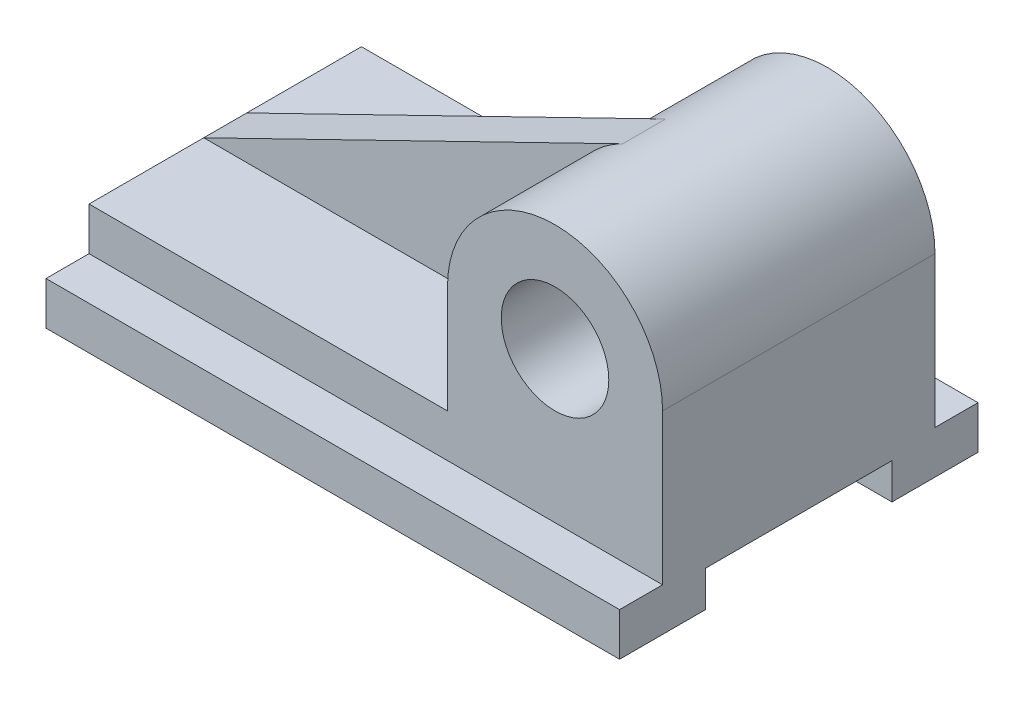
ISO-10303-21;
HEADER;
FILE_DESCRIPTION(('STEP AP214'),'2;1');
FILE_NAME('part.step','',(''),(''),'','','');
FILE_SCHEMA(('AUTOMOTIVE_DESIGN { 1 0 10303 214 1 1 1 1 }'));
ENDSEC;
DATA;
#1=APPLICATION_CONTEXT('core data for automotive mechanical design processes');
#2=APPLICATION_PROTOCOL_DEFINITION('international standard','automotive_design',2000,#1);
#3=PRODUCT_CONTEXT('',#1,'mechanical');
#4=PRODUCT('Part','Part','',(#3));
#5=PRODUCT_RELATED_PRODUCT_CATEGORY('part','',(#4));
#6=PRODUCT_DEFINITION_FORMATION('','',#4);
#7=PRODUCT_DEFINITION_CONTEXT('part definition',#1,'design');
#8=PRODUCT_DEFINITION('design','',#6,#7);
#9=PRODUCT_DEFINITION_SHAPE('','',#8);
#10=(LENGTH_UNIT() NAMED_UNIT(*) SI_UNIT(.MILLI.,.METRE.));
#11=(NAMED_UNIT(*) PLANE_ANGLE_UNIT() SI_UNIT($,.RADIAN.));
#12=(NAMED_UNIT(*) SI_UNIT($,.STERADIAN.) SOLID_ANGLE_UNIT());
#13=UNCERTAINTY_MEASURE_WITH_UNIT(LENGTH_MEASURE(1.E-05),#10,'distance_accuracy_value','');
#14=(GEOMETRIC_REPRESENTATION_CONTEXT(3) GLOBAL_UNCERTAINTY_ASSIGNED_CONTEXT((#13)) GLOBAL_UNIT_ASSIGNED_CONTEXT((#10,
#11,#12)) REPRESENTATION_CONTEXT('',''));
#15=CARTESIAN_POINT('',(0.,0.,0.));
#16=DIRECTION('',(0.,0.,1.));
#17=DIRECTION('',(1.,0.,0.));
#18=AXIS2_PLACEMENT_3D('',#15,#16,#17);
#19=CARTESIAN_POINT('',(0.,0.,-76.));
#20=DIRECTION('',(0.,0.,1.));
#21=DIRECTION('',(1.,0.,0.));
#22=AXIS2_PLACEMENT_3D('',#19,#20,#21);
#23=PLANE('',#22);
#24=CARTESIAN_POINT('',(50.,42.,-76.));
#25=DIRECTION('',(0.,0.,1.));
#26=DIRECTION('',(1.,0.,0.));
#27=AXIS2_PLACEMENT_3D('',#24,#25,#26);
#28=CIRCLE('',#27,15.);
#29=CARTESIAN_POINT('',(65.,42.,-76.));
#30=VERTEX_POINT('',#29);
#31=EDGE_CURVE('E273',#30,#30,#28,.T.);
#32=ORIENTED_EDGE('',*,*,#31,.T.);
#33=EDGE_LOOP('',(#32));
#34=FACE_BOUND('',#33,.T.);
#35=DIRECTION('',(1.,0.,0.));
#36=VECTOR('',#35,1.);
#37=CARTESIAN_POINT('',(80.,0.,-76.));
#38=LINE('',#37,#36);
#39=CARTESIAN_POINT('',(-80.,0.,-76.));
#40=VERTEX_POINT('',#39);
#41=CARTESIAN_POINT('',(80.,0.,-76.));
#42=VERTEX_POINT('',#41);
#43=EDGE_CURVE('E63',#40,#42,#38,.T.);
#44=ORIENTED_EDGE('',*,*,#43,.F.);
#45=DIRECTION('',(0.,-1.,0.));
#46=VECTOR('',#45,1.);
#47=CARTESIAN_POINT('',(-80.,0.,-76.));
#48=LINE('',#47,#46);
#49=CARTESIAN_POINT('',(-80.,12.,-76.));
#50=VERTEX_POINT('',#49);
#51=EDGE_CURVE('E328',#50,#40,#48,.T.);
#52=ORIENTED_EDGE('',*,*,#51,.F.);
#53=DIRECTION('',(1.,0.,0.));
#54=VECTOR('',#53,1.);
#55=CARTESIAN_POINT('',(0.,12.,-76.));
#56=LINE('',#55,#54);
#57=CARTESIAN_POINT('',(20.,12.,-76.));
#58=VERTEX_POINT('',#57);
#59=EDGE_CURVE('E325',#50,#58,#56,.T.);
#60=ORIENTED_EDGE('',*,*,#59,.T.);
#61=DIRECTION('',(0.,1.,0.));
#62=VECTOR('',#61,1.);
#63=CARTESIAN_POINT('',(20.,0.,-76.));
#64=LINE('',#63,#62);
#65=CARTESIAN_POINT('',(20.,42.,-76.));
#66=VERTEX_POINT('',#65);
#67=EDGE_CURVE('E322',#58,#66,#64,.T.);
#68=ORIENTED_EDGE('',*,*,#67,.T.);
#69=CARTESIAN_POINT('',(50.,42.,-76.));
#70=DIRECTION('',(0.,0.,1.));
#71=DIRECTION('',(1.,0.,0.));
#72=AXIS2_PLACEMENT_3D('',#69,#70,#71);
#73=CIRCLE('',#72,30.);
#74=CARTESIAN_POINT('',(80.,42.,-76.));
#75=VERTEX_POINT('',#74);
#76=EDGE_CURVE('E317',#75,#66,#73,.T.);
#77=ORIENTED_EDGE('',*,*,#76,.F.);
#78=DIRECTION('',(0.,-1.,0.));
#79=VECTOR('',#78,1.);
#80=CARTESIAN_POINT('',(80.,0.,-76.));
#81=LINE('',#80,#79);
#82=EDGE_CURVE('E314',#75,#42,#81,.T.);
#83=ORIENTED_EDGE('',*,*,#82,.T.);
#84=EDGE_LOOP('',(#44,#52,#60,#68,#77,#83));
#85=FACE_BOUND('',#84,.T.);
#86=ADVANCED_FACE('F45',(#34,#85),#23,.F.);
#87=CARTESIAN_POINT('',(0.,-12.,-76.));
#88=DIRECTION('',(0.,-1.,0.));
#89=DIRECTION('',(0.,0.,-1.));
#90=AXIS2_PLACEMENT_3D('',#87,#88,#89);
#91=PLANE('',#90);
#92=DIRECTION('',(-1.,0.,0.));
#93=VECTOR('',#92,1.);
#94=CARTESIAN_POINT('',(116.,-12.,-64.));
#95=LINE('',#94,#93);
#96=CARTESIAN_POINT('',(80.,-12.,-64.));
#97=VERTEX_POINT('',#96);
#98=CARTESIAN_POINT('',(-80.,-12.,-64.));
#99=VERTEX_POINT('',#98);
#100=EDGE_CURVE('E249',#97,#99,#95,.T.);
#101=ORIENTED_EDGE('',*,*,#100,.T.);
#102=DIRECTION('',(0.,0.,1.));
#103=VECTOR('',#102,1.);
#104=CARTESIAN_POINT('',(-80.,-12.,-76.));
#105=LINE('',#104,#103);
#106=CARTESIAN_POINT('',(-80.,-12.,-88.0000000000002));
#107=VERTEX_POINT('',#106);
#108=EDGE_CURVE('E187',#107,#99,#105,.T.);
#109=ORIENTED_EDGE('',*,*,#108,.F.);
#110=DIRECTION('',(-1.,0.,0.));
#111=VECTOR('',#110,1.);
#112=CARTESIAN_POINT('',(80.,-12.,-88.0000000000002));
#113=LINE('',#112,#111);
#114=CARTESIAN_POINT('',(80.,-12.,-88.0000000000002));
#115=VERTEX_POINT('',#114);
#116=EDGE_CURVE('E184',#115,#107,#113,.T.);
#117=ORIENTED_EDGE('',*,*,#116,.F.);
#118=DIRECTION('',(0.,0.,1.));
#119=VECTOR('',#118,1.);
#120=CARTESIAN_POINT('',(80.,-12.,-76.));
#121=LINE('',#120,#119);
#122=EDGE_CURVE('E11',#115,#97,#121,.T.);
#123=ORIENTED_EDGE('',*,*,#122,.T.);
#124=EDGE_LOOP('',(#101,#109,#117,#123));
#125=FACE_BOUND('',#124,.T.);
#126=ADVANCED_FACE('F185',(#125),#91,.T.);
#127=CARTESIAN_POINT('',(0.,12.,-76.));
#128=DIRECTION('',(0.,-1.,0.));
#129=DIRECTION('',(0.,0.,-1.));
#130=AXIS2_PLACEMENT_3D('',#127,#128,#129);
#131=PLANE('',#130);
#132=DIRECTION('',(1.,0.,0.));
#133=VECTOR('',#132,1.);
#134=CARTESIAN_POINT('',(-80.,12.,-44.));
#135=LINE('',#134,#133);
#136=CARTESIAN_POINT('',(-80.,12.,-44.));
#137=VERTEX_POINT('',#136);
#138=CARTESIAN_POINT('',(20.,12.,-44.));
#139=VERTEX_POINT('',#138);
#140=EDGE_CURVE('E290',#137,#139,#135,.T.);
#141=ORIENTED_EDGE('',*,*,#140,.T.);
#142=DIRECTION('',(0.,0.,1.));
#143=VECTOR('',#142,1.);
#144=CARTESIAN_POINT('',(20.,12.,-76.));
#145=LINE('',#144,#143);
#146=EDGE_CURVE('E355',#58,#139,#145,.T.);
#147=ORIENTED_EDGE('',*,*,#146,.F.);
#148=ORIENTED_EDGE('',*,*,#59,.F.);
#149=DIRECTION('',(0.,0.,1.));
#150=VECTOR('',#149,1.);
#151=CARTESIAN_POINT('',(-80.,12.,-76.));
#152=LINE('',#151,#150);
#153=EDGE_CURVE('E350',#50,#137,#152,.T.);
#154=ORIENTED_EDGE('',*,*,#153,.T.);
#155=EDGE_LOOP('',(#141,#147,#148,#154));
#156=FACE_BOUND('',#155,.T.);
#157=ADVANCED_FACE('F384',(#156),#131,.F.);
#158=CARTESIAN_POINT('',(20.,0.,-76.));
#159=DIRECTION('',(1.,0.,0.));
#160=DIRECTION('',(0.,0.,-1.));
#161=AXIS2_PLACEMENT_3D('',#158,#159,#160);
#162=PLANE('',#161);
#163=DIRECTION('',(0.,1.,0.));
#164=VECTOR('',#163,1.);
#165=CARTESIAN_POINT('',(20.,12.,-44.));
#166=LINE('',#165,#164);
#167=CARTESIAN_POINT('',(20.,42.,-44.));
#168=VERTEX_POINT('',#167);
#169=EDGE_CURVE('E287',#139,#168,#166,.T.);
#170=ORIENTED_EDGE('',*,*,#169,.T.);
#171=DIRECTION('',(0.,0.,1.));
#172=VECTOR('',#171,1.);
#173=CARTESIAN_POINT('',(20.,42.,-76.));
#174=LINE('',#173,#172);
#175=EDGE_CURVE('E359',#66,#168,#174,.T.);
#176=ORIENTED_EDGE('',*,*,#175,.F.);
#177=ORIENTED_EDGE('',*,*,#67,.F.);
#178=ORIENTED_EDGE('',*,*,#146,.T.);
#179=EDGE_LOOP('',(#170,#176,#177,#178));
#180=FACE_BOUND('',#179,.T.);
#181=ADVANCED_FACE('F378',(#180),#162,.F.);
#182=CARTESIAN_POINT('',(50.,42.,-76.));
#183=DIRECTION('',(0.,0.,1.));
#184=DIRECTION('',(1.,0.,0.));
#185=AXIS2_PLACEMENT_3D('',#182,#183,#184);
#186=CYLINDRICAL_SURFACE('',#185,30.);
#187=ORIENTED_EDGE('',*,*,#175,.T.);
#188=CARTESIAN_POINT('',(50.,42.,-44.));
#189=DIRECTION('',(0.,0.,1.));
#190=DIRECTION('',(1.,0.,0.));
#191=AXIS2_PLACEMENT_3D('',#188,#189,#190);
#192=CIRCLE('',#191,30.);
#193=CARTESIAN_POINT('',(36.8539325842697,68.9662921348315,-44.));
#194=VERTEX_POINT('',#193);
#195=EDGE_CURVE('E282',#194,#168,#192,.T.);
#196=ORIENTED_EDGE('',*,*,#195,.F.);
#197=DIRECTION('',(0.,0.,1.));
#198=VECTOR('',#197,1.);
#199=CARTESIAN_POINT('',(36.8539325842697,68.9662921348314,-44.));
#200=LINE('',#199,#198);
#201=CARTESIAN_POINT('',(36.8539325842697,68.9662921348314,-32.));
#202=VERTEX_POINT('',#201);
#203=EDGE_CURVE('E310',#194,#202,#200,.T.);
#204=ORIENTED_EDGE('',*,*,#203,.T.);
#205=CARTESIAN_POINT('',(50.,42.,-32.));
#206=DIRECTION('',(0.,0.,1.));
#207=DIRECTION('',(1.,0.,0.));
#208=AXIS2_PLACEMENT_3D('',#205,#206,#207);
#209=CIRCLE('',#208,30.);
#210=CARTESIAN_POINT('',(20.,42.,-32.));
#211=VERTEX_POINT('',#210);
#212=EDGE_CURVE('E297',#202,#211,#209,.T.);
#213=ORIENTED_EDGE('',*,*,#212,.T.);
#214=CARTESIAN_POINT('',(20.,42.,0.));
#215=VERTEX_POINT('',#214);
#216=EDGE_CURVE('E362',#211,#215,#174,.T.);
#217=ORIENTED_EDGE('',*,*,#216,.T.);
#218=CARTESIAN_POINT('',(50.,42.,0.));
#219=DIRECTION('',(0.,0.,1.));
#220=DIRECTION('',(1.,0.,0.));
#221=AXIS2_PLACEMENT_3D('',#218,#219,#220);
#222=CIRCLE('',#221,30.);
#223=CARTESIAN_POINT('',(80.,42.,0.));
#224=VERTEX_POINT('',#223);
#225=EDGE_CURVE('E333',#224,#215,#222,.T.);
#226=ORIENTED_EDGE('',*,*,#225,.F.);
#227=DIRECTION('',(0.,0.,1.));
#228=VECTOR('',#227,1.);
#229=CARTESIAN_POINT('',(80.,42.,-76.));
#230=LINE('',#229,#228);
#231=EDGE_CURVE('E49',#75,#224,#230,.T.);
#232=ORIENTED_EDGE('',*,*,#231,.F.);
#233=ORIENTED_EDGE('',*,*,#76,.T.);
#234=EDGE_LOOP('',(#187,#196,#204,#213,#217,#226,#232,#233));
#235=FACE_BOUND('',#234,.T.);
#236=ADVANCED_FACE('F376',(#235),#186,.T.);
#237=CARTESIAN_POINT('',(80.,0.,-76.));
#238=DIRECTION('',(-1.,0.,0.));
#239=DIRECTION('',(0.,0.,1.));
#240=AXIS2_PLACEMENT_3D('',#237,#238,#239);
#241=PLANE('',#240);
#242=DIRECTION('',(0.,0.,-1.));
#243=VECTOR('',#242,1.);
#244=CARTESIAN_POINT('',(80.,-2.,-76.));
#245=LINE('',#244,#243);
#246=CARTESIAN_POINT('',(80.,-1.99999999999999,-12.));
#247=VERTEX_POINT('',#246);
#248=CARTESIAN_POINT('',(80.,-2.,-64.));
#249=VERTEX_POINT('',#248);
#250=EDGE_CURVE('E264',#247,#249,#245,.T.);
#251=ORIENTED_EDGE('',*,*,#250,.T.);
#252=DIRECTION('',(0.,-1.,0.));
#253=VECTOR('',#252,1.);
#254=CARTESIAN_POINT('',(80.,0.,-64.));
#255=LINE('',#254,#253);
#256=EDGE_CURVE('E180',#249,#97,#255,.T.);
#257=ORIENTED_EDGE('',*,*,#256,.T.);
#258=ORIENTED_EDGE('',*,*,#122,.F.);
#259=DIRECTION('',(0.,-1.,0.));
#260=VECTOR('',#259,1.);
#261=CARTESIAN_POINT('',(80.,-12.,-88.0000000000002));
#262=LINE('',#261,#260);
#263=CARTESIAN_POINT('',(80.,0.,-88.0000000000002));
#264=VERTEX_POINT('',#263);
#265=EDGE_CURVE('E179',#264,#115,#262,.T.);
#266=ORIENTED_EDGE('',*,*,#265,.F.);
#267=DIRECTION('',(0.,0.,1.));
#268=VECTOR('',#267,1.);
#269=CARTESIAN_POINT('',(80.,0.,-88.0000000000002));
#270=LINE('',#269,#268);
#271=EDGE_CURVE('E205',#264,#42,#270,.T.);
#272=ORIENTED_EDGE('',*,*,#271,.T.);
#273=ORIENTED_EDGE('',*,*,#82,.F.);
#274=ORIENTED_EDGE('',*,*,#231,.T.);
#275=DIRECTION('',(0.,-1.,0.));
#276=VECTOR('',#275,1.);
#277=CARTESIAN_POINT('',(80.,0.,0.));
#278=LINE('',#277,#276);
#279=CARTESIAN_POINT('',(80.,0.,0.));
#280=VERTEX_POINT('',#279);
#281=EDGE_CURVE('E313',#224,#280,#278,.T.);
#282=ORIENTED_EDGE('',*,*,#281,.T.);
#283=DIRECTION('',(0.,0.,-1.));
#284=VECTOR('',#283,1.);
#285=CARTESIAN_POINT('',(80.,0.,12.0000000000001));
#286=LINE('',#285,#284);
#287=CARTESIAN_POINT('',(80.,0.,12.0000000000001));
#288=VERTEX_POINT('',#287);
#289=EDGE_CURVE('E233',#288,#280,#286,.T.);
#290=ORIENTED_EDGE('',*,*,#289,.F.);
#291=DIRECTION('',(0.,1.,0.));
#292=VECTOR('',#291,1.);
#293=CARTESIAN_POINT('',(80.,-12.,12.0000000000001));
#294=LINE('',#293,#292);
#295=CARTESIAN_POINT('',(80.,-12.,12.0000000000001));
#296=VERTEX_POINT('',#295);
#297=EDGE_CURVE('E221',#296,#288,#294,.T.);
#298=ORIENTED_EDGE('',*,*,#297,.F.);
#299=CARTESIAN_POINT('',(80.,-12.,-12.));
#300=VERTEX_POINT('',#299);
#301=EDGE_CURVE('E55',#300,#296,#121,.T.);
#302=ORIENTED_EDGE('',*,*,#301,.F.);
#303=DIRECTION('',(0.,1.,0.));
#304=VECTOR('',#303,1.);
#305=CARTESIAN_POINT('',(80.,0.,-12.));
#306=LINE('',#305,#304);
#307=EDGE_CURVE('E252',#300,#247,#306,.T.);
#308=ORIENTED_EDGE('',*,*,#307,.T.);
#309=EDGE_LOOP('',(#251,#257,#258,#266,#272,#273,#274,#282,#290,#298,#302,#308));
#310=FACE_BOUND('',#309,.T.);
#311=ADVANCED_FACE('F47',(#310),#241,.F.);
#312=DIRECTION('',(-1.,0.,0.));
#313=VECTOR('',#312,1.);
#314=CARTESIAN_POINT('',(116.,-12.,-12.));
#315=LINE('',#314,#313);
#316=CARTESIAN_POINT('',(-80.,-12.,-12.));
#317=VERTEX_POINT('',#316);
#318=EDGE_CURVE('E248',#300,#317,#315,.T.);
#319=ORIENTED_EDGE('',*,*,#318,.F.);
#320=ORIENTED_EDGE('',*,*,#301,.T.);
#321=DIRECTION('',(1.,0.,0.));
#322=VECTOR('',#321,1.);
#323=CARTESIAN_POINT('',(-80.,-12.,12.0000000000001));
#324=LINE('',#323,#322);
#325=CARTESIAN_POINT('',(-80.,-12.,12.0000000000001));
#326=VERTEX_POINT('',#325);
#327=EDGE_CURVE('E217',#326,#296,#324,.T.);
#328=ORIENTED_EDGE('',*,*,#327,.F.);
#329=EDGE_CURVE('E349',#317,#326,#105,.T.);
#330=ORIENTED_EDGE('',*,*,#329,.F.);
#331=EDGE_LOOP('',(#319,#320,#328,#330));
#332=FACE_BOUND('',#331,.T.);
#333=ADVANCED_FACE('F383',(#332),#91,.T.);
#334=CARTESIAN_POINT('',(-80.,0.,-76.));
#335=DIRECTION('',(-1.,0.,0.));
#336=DIRECTION('',(0.,0.,1.));
#337=AXIS2_PLACEMENT_3D('',#334,#335,#336);
#338=PLANE('',#337);
#339=DIRECTION('',(0.,-1.,0.));
#340=VECTOR('',#339,1.);
#341=CARTESIAN_POINT('',(-80.,-2.,-64.));
#342=LINE('',#341,#340);
#343=CARTESIAN_POINT('',(-80.,-2.,-64.));
#344=VERTEX_POINT('',#343);
#345=EDGE_CURVE('E245',#344,#99,#342,.T.);
#346=ORIENTED_EDGE('',*,*,#345,.F.);
#347=DIRECTION('',(0.,0.,-1.));
#348=VECTOR('',#347,1.);
#349=CARTESIAN_POINT('',(-80.,-1.99999999999999,-12.));
#350=LINE('',#349,#348);
#351=CARTESIAN_POINT('',(-80.,-1.99999999999999,-12.));
#352=VERTEX_POINT('',#351);
#353=EDGE_CURVE('E241',#352,#344,#350,.T.);
#354=ORIENTED_EDGE('',*,*,#353,.F.);
#355=DIRECTION('',(0.,1.,0.));
#356=VECTOR('',#355,1.);
#357=CARTESIAN_POINT('',(-80.,-12.,-12.));
#358=LINE('',#357,#356);
#359=EDGE_CURVE('E237',#317,#352,#358,.T.);
#360=ORIENTED_EDGE('',*,*,#359,.F.);
#361=ORIENTED_EDGE('',*,*,#329,.T.);
#362=DIRECTION('',(0.,-1.,0.));
#363=VECTOR('',#362,1.);
#364=CARTESIAN_POINT('',(-80.,-12.,12.0000000000001));
#365=LINE('',#364,#363);
#366=CARTESIAN_POINT('',(-80.,0.,12.0000000000001));
#367=VERTEX_POINT('',#366);
#368=EDGE_CURVE('E213',#367,#326,#365,.T.);
#369=ORIENTED_EDGE('',*,*,#368,.F.);
#370=DIRECTION('',(0.,0.,-1.));
#371=VECTOR('',#370,1.);
#372=CARTESIAN_POINT('',(-80.,0.,12.0000000000001));
#373=LINE('',#372,#371);
#374=CARTESIAN_POINT('',(-80.,0.,0.));
#375=VERTEX_POINT('',#374);
#376=EDGE_CURVE('E227',#367,#375,#373,.T.);
#377=ORIENTED_EDGE('',*,*,#376,.T.);
#378=DIRECTION('',(0.,-1.,0.));
#379=VECTOR('',#378,1.);
#380=CARTESIAN_POINT('',(-80.,0.,0.));
#381=LINE('',#380,#379);
#382=CARTESIAN_POINT('',(-80.,12.,0.));
#383=VERTEX_POINT('',#382);
#384=EDGE_CURVE('E318',#383,#375,#381,.T.);
#385=ORIENTED_EDGE('',*,*,#384,.F.);
#386=CARTESIAN_POINT('',(-80.,12.,-32.));
#387=VERTEX_POINT('',#386);
#388=EDGE_CURVE('E354',#387,#383,#152,.T.);
#389=ORIENTED_EDGE('',*,*,#388,.F.);
#390=DIRECTION('',(0.,0.,1.));
#391=VECTOR('',#390,1.);
#392=CARTESIAN_POINT('',(-80.,12.,-44.));
#393=LINE('',#392,#391);
#394=EDGE_CURVE('E293',#137,#387,#393,.T.);
#395=ORIENTED_EDGE('',*,*,#394,.F.);
#396=ORIENTED_EDGE('',*,*,#153,.F.);
#397=ORIENTED_EDGE('',*,*,#51,.T.);
#398=DIRECTION('',(0.,0.,1.));
#399=VECTOR('',#398,1.);
#400=CARTESIAN_POINT('',(-80.,0.,-88.0000000000002));
#401=LINE('',#400,#399);
#402=CARTESIAN_POINT('',(-80.,0.,-88.0000000000002));
#403=VERTEX_POINT('',#402);
#404=EDGE_CURVE('E209',#403,#40,#401,.T.);
#405=ORIENTED_EDGE('',*,*,#404,.F.);
#406=DIRECTION('',(0.,1.,0.));
#407=VECTOR('',#406,1.);
#408=CARTESIAN_POINT('',(-80.,-12.,-88.0000000000002));
#409=LINE('',#408,#407);
#410=EDGE_CURVE('E191',#107,#403,#409,.T.);
#411=ORIENTED_EDGE('',*,*,#410,.F.);
#412=ORIENTED_EDGE('',*,*,#108,.T.);
#413=EDGE_LOOP('',(#346,#354,#360,#361,#369,#377,#385,#389,#395,#396,#397,#405,#411,#412));
#414=FACE_BOUND('',#413,.T.);
#415=ADVANCED_FACE('F402',(#414),#338,.T.);
#416=CARTESIAN_POINT('',(20.,12.,-32.));
#417=VERTEX_POINT('',#416);
#418=CARTESIAN_POINT('',(20.,12.,0.));
#419=VERTEX_POINT('',#418);
#420=EDGE_CURVE('E358',#417,#419,#145,.T.);
#421=ORIENTED_EDGE('',*,*,#420,.F.);
#422=DIRECTION('',(1.,0.,0.));
#423=VECTOR('',#422,1.);
#424=CARTESIAN_POINT('',(-80.,12.,-32.));
#425=LINE('',#424,#423);
#426=EDGE_CURVE('E283',#387,#417,#425,.T.);
#427=ORIENTED_EDGE('',*,*,#426,.F.);
#428=ORIENTED_EDGE('',*,*,#388,.T.);
#429=DIRECTION('',(1.,0.,0.));
#430=VECTOR('',#429,1.);
#431=CARTESIAN_POINT('',(0.,12.,0.));
#432=LINE('',#431,#430);
#433=EDGE_CURVE('E341',#383,#419,#432,.T.);
#434=ORIENTED_EDGE('',*,*,#433,.T.);
#435=EDGE_LOOP('',(#421,#427,#428,#434));
#436=FACE_BOUND('',#435,.T.);
#437=ADVANCED_FACE('F406',(#436),#131,.F.);
#438=ORIENTED_EDGE('',*,*,#216,.F.);
#439=DIRECTION('',(0.,1.,0.));
#440=VECTOR('',#439,1.);
#441=CARTESIAN_POINT('',(20.,12.,-32.));
#442=LINE('',#441,#440);
#443=EDGE_CURVE('E300',#417,#211,#442,.T.);
#444=ORIENTED_EDGE('',*,*,#443,.F.);
#445=ORIENTED_EDGE('',*,*,#420,.T.);
#446=DIRECTION('',(0.,1.,0.));
#447=VECTOR('',#446,1.);
#448=CARTESIAN_POINT('',(20.,0.,0.));
#449=LINE('',#448,#447);
#450=EDGE_CURVE('E337',#419,#215,#449,.T.);
#451=ORIENTED_EDGE('',*,*,#450,.T.);
#452=EDGE_LOOP('',(#438,#444,#445,#451));
#453=FACE_BOUND('',#452,.T.);
#454=ADVANCED_FACE('F387',(#453),#162,.F.);
#455=CARTESIAN_POINT('',(0.,0.,0.));
#456=DIRECTION('',(0.,0.,1.));
#457=DIRECTION('',(1.,0.,0.));
#458=AXIS2_PLACEMENT_3D('',#455,#456,#457);
#459=PLANE('',#458);
#460=DIRECTION('',(-1.,0.,0.));
#461=VECTOR('',#460,1.);
#462=CARTESIAN_POINT('',(-80.,0.,0.));
#463=LINE('',#462,#461);
#464=EDGE_CURVE('E71',#280,#375,#463,.T.);
#465=ORIENTED_EDGE('',*,*,#464,.F.);
#466=ORIENTED_EDGE('',*,*,#281,.F.);
#467=ORIENTED_EDGE('',*,*,#225,.T.);
#468=ORIENTED_EDGE('',*,*,#450,.F.);
#469=ORIENTED_EDGE('',*,*,#433,.F.);
#470=ORIENTED_EDGE('',*,*,#384,.T.);
#471=EDGE_LOOP('',(#465,#466,#467,#468,#469,#470));
#472=FACE_BOUND('',#471,.T.);
#473=CARTESIAN_POINT('',(50.,42.,0.));
#474=DIRECTION('',(0.,0.,1.));
#475=DIRECTION('',(1.,0.,0.));
#476=AXIS2_PLACEMENT_3D('',#473,#474,#475);
#477=CIRCLE('',#476,15.);
#478=CARTESIAN_POINT('',(65.,42.,0.));
#479=VERTEX_POINT('',#478);
#480=EDGE_CURVE('E269',#479,#479,#477,.T.);
#481=ORIENTED_EDGE('',*,*,#480,.F.);
#482=EDGE_LOOP('',(#481));
#483=FACE_BOUND('',#482,.T.);
#484=ADVANCED_FACE('F373',(#472,#483),#459,.T.);
#485=CARTESIAN_POINT('',(-80.,12.,-44.));
#486=DIRECTION('',(0.438202247191011,-0.898876404494382,0.));
#487=DIRECTION('',(0.898876404494382,0.438202247191011,0.));
#488=AXIS2_PLACEMENT_3D('',#485,#486,#487);
#489=PLANE('',#488);
#490=DIRECTION('',(0.898876404494382,0.438202247191011,0.));
#491=VECTOR('',#490,1.);
#492=CARTESIAN_POINT('',(-80.,12.,-32.));
#493=LINE('',#492,#491);
#494=EDGE_CURVE('E277',#387,#202,#493,.T.);
#495=ORIENTED_EDGE('',*,*,#494,.T.);
#496=ORIENTED_EDGE('',*,*,#203,.F.);
#497=DIRECTION('',(0.898876404494382,0.438202247191011,0.));
#498=VECTOR('',#497,1.);
#499=CARTESIAN_POINT('',(-80.,12.,-44.));
#500=LINE('',#499,#498);
#501=EDGE_CURVE('E278',#137,#194,#500,.T.);
#502=ORIENTED_EDGE('',*,*,#501,.F.);
#503=ORIENTED_EDGE('',*,*,#394,.T.);
#504=EDGE_LOOP('',(#495,#496,#502,#503));
#505=FACE_BOUND('',#504,.T.);
#506=ADVANCED_FACE('F397',(#505),#489,.F.);
#507=CARTESIAN_POINT('',(50.,42.,-44.));
#508=DIRECTION('',(0.,0.,1.));
#509=DIRECTION('',(1.,0.,0.));
#510=AXIS2_PLACEMENT_3D('',#507,#508,#509);
#511=PLANE('',#510);
#512=ORIENTED_EDGE('',*,*,#501,.T.);
#513=ORIENTED_EDGE('',*,*,#195,.T.);
#514=ORIENTED_EDGE('',*,*,#169,.F.);
#515=ORIENTED_EDGE('',*,*,#140,.F.);
#516=EDGE_LOOP('',(#512,#513,#514,#515));
#517=FACE_BOUND('',#516,.T.);
#518=ADVANCED_FACE('F430',(#517),#511,.F.);
#519=CARTESIAN_POINT('',(50.,42.,-32.));
#520=DIRECTION('',(0.,0.,1.));
#521=DIRECTION('',(1.,0.,0.));
#522=AXIS2_PLACEMENT_3D('',#519,#520,#521);
#523=PLANE('',#522);
#524=ORIENTED_EDGE('',*,*,#494,.F.);
#525=ORIENTED_EDGE('',*,*,#426,.T.);
#526=ORIENTED_EDGE('',*,*,#443,.T.);
#527=ORIENTED_EDGE('',*,*,#212,.F.);
#528=EDGE_LOOP('',(#524,#525,#526,#527));
#529=FACE_BOUND('',#528,.T.);
#530=ADVANCED_FACE('F418',(#529),#523,.T.);
#531=CARTESIAN_POINT('',(50.,42.,-95.0000000000001));
#532=DIRECTION('',(0.,0.,1.));
#533=DIRECTION('',(1.,0.,0.));
#534=AXIS2_PLACEMENT_3D('',#531,#532,#533);
#535=CYLINDRICAL_SURFACE('',#534,15.);
#536=ORIENTED_EDGE('',*,*,#480,.T.);
#537=EDGE_LOOP('',(#536));
#538=FACE_BOUND('',#537,.T.);
#539=ORIENTED_EDGE('',*,*,#31,.F.);
#540=EDGE_LOOP('',(#539));
#541=FACE_BOUND('',#540,.T.);
#542=ADVANCED_FACE('F458',(#538,#541),#535,.F.);
#543=CARTESIAN_POINT('',(116.,-2.,-64.));
#544=DIRECTION('',(0.,0.,-1.));
#545=DIRECTION('',(-1.,0.,0.));
#546=AXIS2_PLACEMENT_3D('',#543,#544,#545);
#547=PLANE('',#546);
#548=DIRECTION('',(-1.,0.,0.));
#549=VECTOR('',#548,1.);
#550=CARTESIAN_POINT('',(116.,-2.,-64.));
#551=LINE('',#550,#549);
#552=EDGE_CURVE('E253',#249,#344,#551,.T.);
#553=ORIENTED_EDGE('',*,*,#552,.T.);
#554=ORIENTED_EDGE('',*,*,#345,.T.);
#555=ORIENTED_EDGE('',*,*,#100,.F.);
#556=ORIENTED_EDGE('',*,*,#256,.F.);
#557=EDGE_LOOP('',(#553,#554,#555,#556));
#558=FACE_BOUND('',#557,.T.);
#559=ADVANCED_FACE('F454',(#558),#547,.F.);
#560=CARTESIAN_POINT('',(116.,-1.99999999999999,-12.));
#561=DIRECTION('',(0.,1.,0.));
#562=DIRECTION('',(0.,0.,1.));
#563=AXIS2_PLACEMENT_3D('',#560,#561,#562);
#564=PLANE('',#563);
#565=DIRECTION('',(-1.,0.,0.));
#566=VECTOR('',#565,1.);
#567=CARTESIAN_POINT('',(116.,-1.99999999999999,-12.));
#568=LINE('',#567,#566);
#569=EDGE_CURVE('E256',#247,#352,#568,.T.);
#570=ORIENTED_EDGE('',*,*,#569,.T.);
#571=ORIENTED_EDGE('',*,*,#353,.T.);
#572=ORIENTED_EDGE('',*,*,#552,.F.);
#573=ORIENTED_EDGE('',*,*,#250,.F.);
#574=EDGE_LOOP('',(#570,#571,#572,#573));
#575=FACE_BOUND('',#574,.T.);
#576=ADVANCED_FACE('F457',(#575),#564,.F.);
#577=CARTESIAN_POINT('',(116.,-12.,-12.));
#578=DIRECTION('',(0.,0.,1.));
#579=DIRECTION('',(1.,0.,0.));
#580=AXIS2_PLACEMENT_3D('',#577,#578,#579);
#581=PLANE('',#580);
#582=ORIENTED_EDGE('',*,*,#318,.T.);
#583=ORIENTED_EDGE('',*,*,#359,.T.);
#584=ORIENTED_EDGE('',*,*,#569,.F.);
#585=ORIENTED_EDGE('',*,*,#307,.F.);
#586=EDGE_LOOP('',(#582,#583,#584,#585));
#587=FACE_BOUND('',#586,.T.);
#588=ADVANCED_FACE('F452',(#587),#581,.F.);
#589=CARTESIAN_POINT('',(-80.,0.,12.0000000000001));
#590=DIRECTION('',(0.,-1.,0.));
#591=DIRECTION('',(0.,0.,-1.));
#592=AXIS2_PLACEMENT_3D('',#589,#590,#591);
#593=PLANE('',#592);
#594=ORIENTED_EDGE('',*,*,#464,.T.);
#595=ORIENTED_EDGE('',*,*,#376,.F.);
#596=DIRECTION('',(-1.,0.,0.));
#597=VECTOR('',#596,1.);
#598=CARTESIAN_POINT('',(-80.,0.,12.0000000000001));
#599=LINE('',#598,#597);
#600=EDGE_CURVE('E224',#288,#367,#599,.T.);
#601=ORIENTED_EDGE('',*,*,#600,.F.);
#602=ORIENTED_EDGE('',*,*,#289,.T.);
#603=EDGE_LOOP('',(#594,#595,#601,#602));
#604=FACE_BOUND('',#603,.T.);
#605=ADVANCED_FACE('F446',(#604),#593,.F.);
#606=CARTESIAN_POINT('',(0.,0.,12.0000000000001));
#607=DIRECTION('',(0.,0.,-1.));
#608=DIRECTION('',(-1.,0.,0.));
#609=AXIS2_PLACEMENT_3D('',#606,#607,#608);
#610=PLANE('',#609);
#611=ORIENTED_EDGE('',*,*,#368,.T.);
#612=ORIENTED_EDGE('',*,*,#327,.T.);
#613=ORIENTED_EDGE('',*,*,#297,.T.);
#614=ORIENTED_EDGE('',*,*,#600,.T.);
#615=EDGE_LOOP('',(#611,#612,#613,#614));
#616=FACE_BOUND('',#615,.T.);
#617=ADVANCED_FACE('F439',(#616),#610,.F.);
#618=CARTESIAN_POINT('',(80.,0.,-88.0000000000002));
#619=DIRECTION('',(0.,-1.,0.));
#620=DIRECTION('',(0.,0.,-1.));
#621=AXIS2_PLACEMENT_3D('',#618,#619,#620);
#622=PLANE('',#621);
#623=ORIENTED_EDGE('',*,*,#43,.T.);
#624=ORIENTED_EDGE('',*,*,#271,.F.);
#625=DIRECTION('',(1.,0.,0.));
#626=VECTOR('',#625,1.);
#627=CARTESIAN_POINT('',(80.,0.,-88.0000000000002));
#628=LINE('',#627,#626);
#629=EDGE_CURVE('E195',#403,#264,#628,.T.);
#630=ORIENTED_EDGE('',*,*,#629,.F.);
#631=ORIENTED_EDGE('',*,*,#404,.T.);
#632=EDGE_LOOP('',(#623,#624,#630,#631));
#633=FACE_BOUND('',#632,.T.);
#634=ADVANCED_FACE('F437',(#633),#622,.F.);
#635=CARTESIAN_POINT('',(0.,0.,-88.0000000000002));
#636=DIRECTION('',(0.,0.,1.));
#637=DIRECTION('',(1.,0.,0.));
#638=AXIS2_PLACEMENT_3D('',#635,#636,#637);
#639=PLANE('',#638);
#640=ORIENTED_EDGE('',*,*,#265,.T.);
#641=ORIENTED_EDGE('',*,*,#116,.T.);
#642=ORIENTED_EDGE('',*,*,#410,.T.);
#643=ORIENTED_EDGE('',*,*,#629,.T.);
#644=EDGE_LOOP('',(#640,#641,#642,#643));
#645=FACE_BOUND('',#644,.T.);
#646=ADVANCED_FACE('F193',(#645),#639,.F.);
#647=CLOSED_SHELL('',(#86,#126,#157,#181,#236,#311,#333,#415,#437,#454,#484,#506,#518,#530,#542,
#559,#576,#588,#605,#617,#634,#646));
#648=MANIFOLD_SOLID_BREP('B2',#647);
#649=ADVANCED_BREP_SHAPE_REPRESENTATION('',(#18,#648),#14);
#650=SHAPE_DEFINITION_REPRESENTATION(#9,#649);
ENDSEC;
END-ISO-10303-21;
